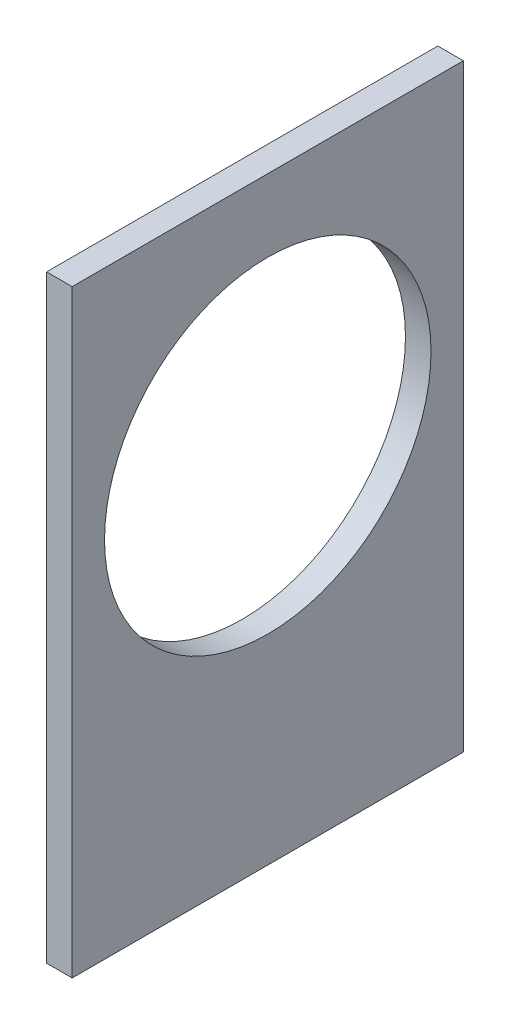
ISO-10303-21;
HEADER;
FILE_DESCRIPTION(('STEP AP214'),'2;1');
FILE_NAME('part.step','',(''),(''),'','','');
FILE_SCHEMA(('AUTOMOTIVE_DESIGN { 1 0 10303 214 1 1 1 1 }'));
ENDSEC;
DATA;
#1=APPLICATION_CONTEXT('core data for automotive mechanical design processes');
#2=APPLICATION_PROTOCOL_DEFINITION('international standard','automotive_design',2000,#1);
#3=PRODUCT_CONTEXT('',#1,'mechanical');
#4=PRODUCT('Part','Part','',(#3));
#5=PRODUCT_RELATED_PRODUCT_CATEGORY('part','',(#4));
#6=PRODUCT_DEFINITION_FORMATION('','',#4);
#7=PRODUCT_DEFINITION_CONTEXT('part definition',#1,'design');
#8=PRODUCT_DEFINITION('design','',#6,#7);
#9=PRODUCT_DEFINITION_SHAPE('','',#8);
#10=(LENGTH_UNIT() NAMED_UNIT(*) SI_UNIT(.MILLI.,.METRE.));
#11=(NAMED_UNIT(*) PLANE_ANGLE_UNIT() SI_UNIT($,.RADIAN.));
#12=(NAMED_UNIT(*) SI_UNIT($,.STERADIAN.) SOLID_ANGLE_UNIT());
#13=UNCERTAINTY_MEASURE_WITH_UNIT(LENGTH_MEASURE(1.E-05),#10,'distance_accuracy_value','');
#14=(GEOMETRIC_REPRESENTATION_CONTEXT(3) GLOBAL_UNCERTAINTY_ASSIGNED_CONTEXT((#13)) GLOBAL_UNIT_ASSIGNED_CONTEXT((#10,
#11,#12)) REPRESENTATION_CONTEXT('',''));
#15=CARTESIAN_POINT('',(0.,0.,0.));
#16=DIRECTION('',(0.,0.,1.));
#17=DIRECTION('',(1.,0.,0.));
#18=AXIS2_PLACEMENT_3D('',#15,#16,#17);
#19=CARTESIAN_POINT('',(3.2,0.,0.));
#20=DIRECTION('',(0.,0.,-1.));
#21=DIRECTION('',(-1.,0.,0.));
#22=AXIS2_PLACEMENT_3D('',#19,#20,#21);
#23=PLANE('',#22);
#24=DIRECTION('',(0.,-1.,0.));
#25=VECTOR('',#24,1.);
#26=CARTESIAN_POINT('',(0.,0.,0.));
#27=LINE('',#26,#25);
#28=CARTESIAN_POINT('',(0.,75.,0.));
#29=VERTEX_POINT('',#28);
#30=CARTESIAN_POINT('',(0.,0.,0.));
#31=VERTEX_POINT('',#30);
#32=EDGE_CURVE('E96',#29,#31,#27,.T.);
#33=ORIENTED_EDGE('',*,*,#32,.T.);
#34=DIRECTION('',(-1.,0.,0.));
#35=VECTOR('',#34,1.);
#36=CARTESIAN_POINT('',(3.2,0.,0.));
#37=LINE('',#36,#35);
#38=CARTESIAN_POINT('',(3.2,0.,0.));
#39=VERTEX_POINT('',#38);
#40=EDGE_CURVE('E11',#39,#31,#37,.T.);
#41=ORIENTED_EDGE('',*,*,#40,.F.);
#42=DIRECTION('',(0.,-1.,0.));
#43=VECTOR('',#42,1.);
#44=CARTESIAN_POINT('',(3.2,0.,0.));
#45=LINE('',#44,#43);
#46=CARTESIAN_POINT('',(3.2,75.,0.));
#47=VERTEX_POINT('',#46);
#48=EDGE_CURVE('E84',#47,#39,#45,.T.);
#49=ORIENTED_EDGE('',*,*,#48,.F.);
#50=DIRECTION('',(-1.,0.,0.));
#51=VECTOR('',#50,1.);
#52=CARTESIAN_POINT('',(3.2,75.,0.));
#53=LINE('',#52,#51);
#54=EDGE_CURVE('E92',#47,#29,#53,.T.);
#55=ORIENTED_EDGE('',*,*,#54,.T.);
#56=EDGE_LOOP('',(#33,#41,#49,#55));
#57=FACE_BOUND('',#56,.T.);
#58=ADVANCED_FACE('F33',(#57),#23,.F.);
#59=CARTESIAN_POINT('',(3.2,0.,0.));
#60=DIRECTION('',(0.,1.,0.));
#61=DIRECTION('',(0.,0.,1.));
#62=AXIS2_PLACEMENT_3D('',#59,#60,#61);
#63=PLANE('',#62);
#64=DIRECTION('',(0.,0.,-1.));
#65=VECTOR('',#64,1.);
#66=CARTESIAN_POINT('',(0.,0.,0.));
#67=LINE('',#66,#65);
#68=CARTESIAN_POINT('',(0.,0.,-49.));
#69=VERTEX_POINT('',#68);
#70=EDGE_CURVE('E88',#31,#69,#67,.T.);
#71=ORIENTED_EDGE('',*,*,#70,.T.);
#72=DIRECTION('',(-1.,0.,0.));
#73=VECTOR('',#72,1.);
#74=CARTESIAN_POINT('',(3.2,0.,-49.));
#75=LINE('',#74,#73);
#76=CARTESIAN_POINT('',(3.2,0.,-49.));
#77=VERTEX_POINT('',#76);
#78=EDGE_CURVE('E41',#77,#69,#75,.T.);
#79=ORIENTED_EDGE('',*,*,#78,.F.);
#80=DIRECTION('',(0.,0.,-1.));
#81=VECTOR('',#80,1.);
#82=CARTESIAN_POINT('',(3.2,0.,0.));
#83=LINE('',#82,#81);
#84=EDGE_CURVE('E79',#39,#77,#83,.T.);
#85=ORIENTED_EDGE('',*,*,#84,.F.);
#86=ORIENTED_EDGE('',*,*,#40,.T.);
#87=EDGE_LOOP('',(#71,#79,#85,#86));
#88=FACE_BOUND('',#87,.T.);
#89=ADVANCED_FACE('F87',(#88),#63,.F.);
#90=CARTESIAN_POINT('',(3.2,0.,-49.));
#91=DIRECTION('',(0.,0.,1.));
#92=DIRECTION('',(1.,0.,0.));
#93=AXIS2_PLACEMENT_3D('',#90,#91,#92);
#94=PLANE('',#93);
#95=DIRECTION('',(0.,1.,0.));
#96=VECTOR('',#95,1.);
#97=CARTESIAN_POINT('',(0.,0.,-49.));
#98=LINE('',#97,#96);
#99=CARTESIAN_POINT('',(0.,75.,-49.));
#100=VERTEX_POINT('',#99);
#101=EDGE_CURVE('E66',#69,#100,#98,.T.);
#102=ORIENTED_EDGE('',*,*,#101,.T.);
#103=DIRECTION('',(-1.,0.,0.));
#104=VECTOR('',#103,1.);
#105=CARTESIAN_POINT('',(3.2,75.,-49.));
#106=LINE('',#105,#104);
#107=CARTESIAN_POINT('',(3.2,75.,-49.));
#108=VERTEX_POINT('',#107);
#109=EDGE_CURVE('E89',#108,#100,#106,.T.);
#110=ORIENTED_EDGE('',*,*,#109,.F.);
#111=DIRECTION('',(0.,1.,0.));
#112=VECTOR('',#111,1.);
#113=CARTESIAN_POINT('',(3.2,0.,-49.));
#114=LINE('',#113,#112);
#115=EDGE_CURVE('E82',#77,#108,#114,.T.);
#116=ORIENTED_EDGE('',*,*,#115,.F.);
#117=ORIENTED_EDGE('',*,*,#78,.T.);
#118=EDGE_LOOP('',(#102,#110,#116,#117));
#119=FACE_BOUND('',#118,.T.);
#120=ADVANCED_FACE('F90',(#119),#94,.F.);
#121=CARTESIAN_POINT('',(3.2,75.,0.));
#122=DIRECTION('',(0.,-1.,0.));
#123=DIRECTION('',(0.,0.,-1.));
#124=AXIS2_PLACEMENT_3D('',#121,#122,#123);
#125=PLANE('',#124);
#126=DIRECTION('',(0.,0.,1.));
#127=VECTOR('',#126,1.);
#128=CARTESIAN_POINT('',(0.,75.,0.));
#129=LINE('',#128,#127);
#130=EDGE_CURVE('E72',#100,#29,#129,.T.);
#131=ORIENTED_EDGE('',*,*,#130,.T.);
#132=ORIENTED_EDGE('',*,*,#54,.F.);
#133=DIRECTION('',(0.,0.,1.));
#134=VECTOR('',#133,1.);
#135=CARTESIAN_POINT('',(3.2,75.,0.));
#136=LINE('',#135,#134);
#137=EDGE_CURVE('E49',#108,#47,#136,.T.);
#138=ORIENTED_EDGE('',*,*,#137,.F.);
#139=ORIENTED_EDGE('',*,*,#109,.T.);
#140=EDGE_LOOP('',(#131,#132,#138,#139));
#141=FACE_BOUND('',#140,.T.);
#142=ADVANCED_FACE('F104',(#141),#125,.F.);
#143=CARTESIAN_POINT('',(3.2,0.,0.));
#144=DIRECTION('',(-1.,0.,0.));
#145=DIRECTION('',(0.,0.,1.));
#146=AXIS2_PLACEMENT_3D('',#143,#144,#145);
#147=PLANE('',#146);
#148=CARTESIAN_POINT('',(3.2,45.4958254529938,-24.5));
#149=DIRECTION('',(1.,0.,0.));
#150=DIRECTION('',(0.,0.,1.));
#151=AXIS2_PLACEMENT_3D('',#148,#149,#150);
#152=CIRCLE('',#151,20.445);
#153=CARTESIAN_POINT('',(3.2,45.4958254529938,-4.055));
#154=VERTEX_POINT('',#153);
#155=EDGE_CURVE('E99',#154,#154,#152,.T.);
#156=ORIENTED_EDGE('',*,*,#155,.F.);
#157=EDGE_LOOP('',(#156));
#158=FACE_BOUND('',#157,.T.);
#159=ORIENTED_EDGE('',*,*,#48,.T.);
#160=ORIENTED_EDGE('',*,*,#84,.T.);
#161=ORIENTED_EDGE('',*,*,#115,.T.);
#162=ORIENTED_EDGE('',*,*,#137,.T.);
#163=EDGE_LOOP('',(#159,#160,#161,#162));
#164=FACE_BOUND('',#163,.T.);
#165=ADVANCED_FACE('F80',(#158,#164),#147,.F.);
#166=CARTESIAN_POINT('',(0.,0.,0.));
#167=DIRECTION('',(-1.,0.,0.));
#168=DIRECTION('',(0.,0.,1.));
#169=AXIS2_PLACEMENT_3D('',#166,#167,#168);
#170=PLANE('',#169);
#171=CARTESIAN_POINT('',(0.,45.4958254529938,-24.5));
#172=DIRECTION('',(-1.,0.,0.));
#173=DIRECTION('',(0.,0.,1.));
#174=AXIS2_PLACEMENT_3D('',#171,#172,#173);
#175=CIRCLE('',#174,20.445);
#176=CARTESIAN_POINT('',(0.,45.4958254529938,-4.055));
#177=VERTEX_POINT('',#176);
#178=EDGE_CURVE('E110',#177,#177,#175,.F.);
#179=ORIENTED_EDGE('',*,*,#178,.T.);
#180=EDGE_LOOP('',(#179));
#181=FACE_BOUND('',#180,.T.);
#182=ORIENTED_EDGE('',*,*,#32,.F.);
#183=ORIENTED_EDGE('',*,*,#130,.F.);
#184=ORIENTED_EDGE('',*,*,#101,.F.);
#185=ORIENTED_EDGE('',*,*,#70,.F.);
#186=EDGE_LOOP('',(#182,#183,#184,#185));
#187=FACE_BOUND('',#186,.T.);
#188=ADVANCED_FACE('F107',(#181,#187),#170,.T.);
#189=CARTESIAN_POINT('',(-0.00100000000000013,45.4958254529938,-24.5));
#190=DIRECTION('',(1.,0.,0.));
#191=DIRECTION('',(0.,0.,-1.));
#192=AXIS2_PLACEMENT_3D('',#189,#190,#191);
#193=CYLINDRICAL_SURFACE('',#192,20.445);
#194=ORIENTED_EDGE('',*,*,#178,.F.);
#195=EDGE_LOOP('',(#194));
#196=FACE_BOUND('',#195,.T.);
#197=ORIENTED_EDGE('',*,*,#155,.T.);
#198=EDGE_LOOP('',(#197));
#199=FACE_BOUND('',#198,.T.);
#200=ADVANCED_FACE('F116',(#196,#199),#193,.F.);
#201=CLOSED_SHELL('',(#58,#89,#120,#142,#165,#188,#200));
#202=MANIFOLD_SOLID_BREP('B2',#201);
#203=ADVANCED_BREP_SHAPE_REPRESENTATION('',(#18,#202),#14);
#204=SHAPE_DEFINITION_REPRESENTATION(#9,#203);
ENDSEC;
END-ISO-10303-21;
